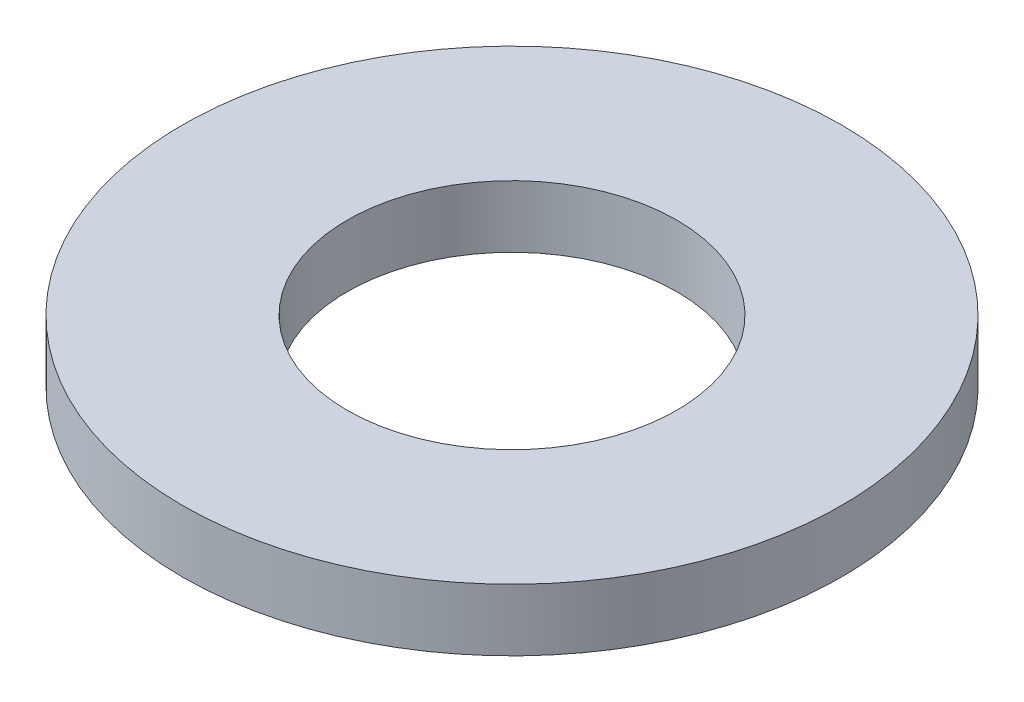
ISO-10303-21;
HEADER;
FILE_DESCRIPTION(('STEP AP214'),'2;1');
FILE_NAME('part.step','',(''),(''),'','','');
FILE_SCHEMA(('AUTOMOTIVE_DESIGN { 1 0 10303 214 1 1 1 1 }'));
ENDSEC;
DATA;
#1=APPLICATION_CONTEXT('core data for automotive mechanical design processes');
#2=APPLICATION_PROTOCOL_DEFINITION('international standard','automotive_design',2000,#1);
#3=PRODUCT_CONTEXT('',#1,'mechanical');
#4=PRODUCT('Part','Part','',(#3));
#5=PRODUCT_RELATED_PRODUCT_CATEGORY('part','',(#4));
#6=PRODUCT_DEFINITION_FORMATION('','',#4);
#7=PRODUCT_DEFINITION_CONTEXT('part definition',#1,'design');
#8=PRODUCT_DEFINITION('design','',#6,#7);
#9=PRODUCT_DEFINITION_SHAPE('','',#8);
#10=(LENGTH_UNIT() NAMED_UNIT(*) SI_UNIT(.MILLI.,.METRE.));
#11=(NAMED_UNIT(*) PLANE_ANGLE_UNIT() SI_UNIT($,.RADIAN.));
#12=(NAMED_UNIT(*) SI_UNIT($,.STERADIAN.) SOLID_ANGLE_UNIT());
#13=UNCERTAINTY_MEASURE_WITH_UNIT(LENGTH_MEASURE(1.E-05),#10,'distance_accuracy_value','');
#14=(GEOMETRIC_REPRESENTATION_CONTEXT(3) GLOBAL_UNCERTAINTY_ASSIGNED_CONTEXT((#13)) GLOBAL_UNIT_ASSIGNED_CONTEXT((#10,
#11,#12)) REPRESENTATION_CONTEXT('',''));
#15=CARTESIAN_POINT('',(0.,0.,0.));
#16=DIRECTION('',(0.,0.,1.));
#17=DIRECTION('',(1.,0.,0.));
#18=AXIS2_PLACEMENT_3D('',#15,#16,#17);
#19=CARTESIAN_POINT('',(0.,16.,0.));
#20=DIRECTION('',(0.,-1.,0.));
#21=DIRECTION('',(0.,0.,-1.));
#22=AXIS2_PLACEMENT_3D('',#19,#20,#21);
#23=CYLINDRICAL_SURFACE('',#22,85.);
#24=CARTESIAN_POINT('',(0.,16.,0.));
#25=DIRECTION('',(0.,1.,0.));
#26=DIRECTION('',(0.,0.,1.));
#27=AXIS2_PLACEMENT_3D('',#24,#25,#26);
#28=CIRCLE('',#27,85.);
#29=CARTESIAN_POINT('',(0.,16.,85.));
#30=VERTEX_POINT('',#29);
#31=EDGE_CURVE('E10',#30,#30,#28,.T.);
#32=ORIENTED_EDGE('',*,*,#31,.F.);
#33=EDGE_LOOP('',(#32));
#34=FACE_BOUND('',#33,.T.);
#35=CARTESIAN_POINT('',(0.,0.,0.));
#36=DIRECTION('',(0.,1.,0.));
#37=DIRECTION('',(0.,0.,1.));
#38=AXIS2_PLACEMENT_3D('',#35,#36,#37);
#39=CIRCLE('',#38,85.);
#40=CARTESIAN_POINT('',(0.,0.,85.));
#41=VERTEX_POINT('',#40);
#42=EDGE_CURVE('E37',#41,#41,#39,.T.);
#43=ORIENTED_EDGE('',*,*,#42,.T.);
#44=EDGE_LOOP('',(#43));
#45=FACE_BOUND('',#44,.T.);
#46=ADVANCED_FACE('F40',(#34,#45),#23,.T.);
#47=CARTESIAN_POINT('',(0.,16.,0.));
#48=DIRECTION('',(0.,1.,0.));
#49=DIRECTION('',(0.,0.,1.));
#50=AXIS2_PLACEMENT_3D('',#47,#48,#49);
#51=PLANE('',#50);
#52=CARTESIAN_POINT('',(0.,16.,0.));
#53=DIRECTION('',(0.,1.,0.));
#54=DIRECTION('',(0.,0.,1.));
#55=AXIS2_PLACEMENT_3D('',#52,#53,#54);
#56=CIRCLE('',#55,42.5);
#57=CARTESIAN_POINT('',(0.,16.,42.5));
#58=VERTEX_POINT('',#57);
#59=EDGE_CURVE('E50',#58,#58,#56,.T.);
#60=ORIENTED_EDGE('',*,*,#59,.F.);
#61=EDGE_LOOP('',(#60));
#62=FACE_BOUND('',#61,.T.);
#63=ORIENTED_EDGE('',*,*,#31,.T.);
#64=EDGE_LOOP('',(#63));
#65=FACE_BOUND('',#64,.T.);
#66=ADVANCED_FACE('F59',(#62,#65),#51,.T.);
#67=CARTESIAN_POINT('',(0.,0.,0.));
#68=DIRECTION('',(0.,1.,0.));
#69=DIRECTION('',(0.,0.,1.));
#70=AXIS2_PLACEMENT_3D('',#67,#68,#69);
#71=PLANE('',#70);
#72=CARTESIAN_POINT('',(0.,0.,0.));
#73=DIRECTION('',(0.,1.,0.));
#74=DIRECTION('',(0.,0.,1.));
#75=AXIS2_PLACEMENT_3D('',#72,#73,#74);
#76=CIRCLE('',#75,42.5);
#77=CARTESIAN_POINT('',(0.,0.,42.5));
#78=VERTEX_POINT('',#77);
#79=EDGE_CURVE('E47',#78,#78,#76,.T.);
#80=ORIENTED_EDGE('',*,*,#79,.T.);
#81=EDGE_LOOP('',(#80));
#82=FACE_BOUND('',#81,.T.);
#83=ORIENTED_EDGE('',*,*,#42,.F.);
#84=EDGE_LOOP('',(#83));
#85=FACE_BOUND('',#84,.T.);
#86=ADVANCED_FACE('F58',(#82,#85),#71,.F.);
#87=CARTESIAN_POINT('',(0.,16.,0.));
#88=DIRECTION('',(0.,-1.,0.));
#89=DIRECTION('',(0.,0.,-1.));
#90=AXIS2_PLACEMENT_3D('',#87,#88,#89);
#91=CYLINDRICAL_SURFACE('',#90,42.5);
#92=ORIENTED_EDGE('',*,*,#59,.T.);
#93=EDGE_LOOP('',(#92));
#94=FACE_BOUND('',#93,.T.);
#95=ORIENTED_EDGE('',*,*,#79,.F.);
#96=EDGE_LOOP('',(#95));
#97=FACE_BOUND('',#96,.T.);
#98=ADVANCED_FACE('F54',(#94,#97),#91,.F.);
#99=CLOSED_SHELL('',(#46,#66,#86,#98));
#100=MANIFOLD_SOLID_BREP('B2',#99);
#101=ADVANCED_BREP_SHAPE_REPRESENTATION('',(#18,#100),#14);
#102=SHAPE_DEFINITION_REPRESENTATION(#9,#101);
ENDSEC;
END-ISO-10303-21;
